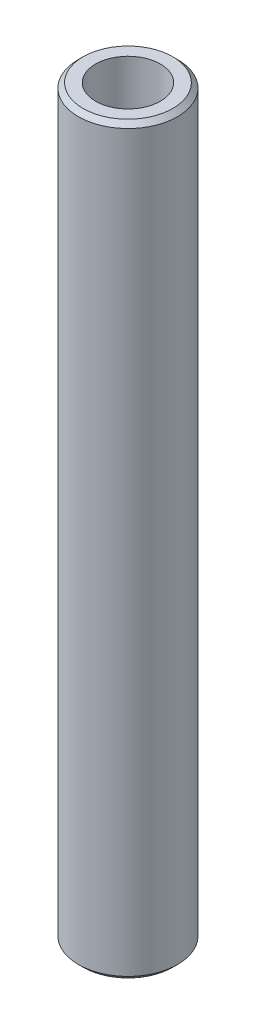
ISO-10303-21;
HEADER;
FILE_DESCRIPTION(('STEP AP214'),'2;1');
FILE_NAME('part.step','',(''),(''),'','','');
FILE_SCHEMA(('AUTOMOTIVE_DESIGN { 1 0 10303 214 1 1 1 1 }'));
ENDSEC;
DATA;
#1=APPLICATION_CONTEXT('core data for automotive mechanical design processes');
#2=APPLICATION_PROTOCOL_DEFINITION('international standard','automotive_design',2000,#1);
#3=PRODUCT_CONTEXT('',#1,'mechanical');
#4=PRODUCT('Part','Part','',(#3));
#5=PRODUCT_RELATED_PRODUCT_CATEGORY('part','',(#4));
#6=PRODUCT_DEFINITION_FORMATION('','',#4);
#7=PRODUCT_DEFINITION_CONTEXT('part definition',#1,'design');
#8=PRODUCT_DEFINITION('design','',#6,#7);
#9=PRODUCT_DEFINITION_SHAPE('','',#8);
#10=(LENGTH_UNIT() NAMED_UNIT(*) SI_UNIT(.MILLI.,.METRE.));
#11=(NAMED_UNIT(*) PLANE_ANGLE_UNIT() SI_UNIT($,.RADIAN.));
#12=(NAMED_UNIT(*) SI_UNIT($,.STERADIAN.) SOLID_ANGLE_UNIT());
#13=UNCERTAINTY_MEASURE_WITH_UNIT(LENGTH_MEASURE(1.E-05),#10,'distance_accuracy_value','');
#14=(GEOMETRIC_REPRESENTATION_CONTEXT(3) GLOBAL_UNCERTAINTY_ASSIGNED_CONTEXT((#13)) GLOBAL_UNIT_ASSIGNED_CONTEXT((#10,
#11,#12)) REPRESENTATION_CONTEXT('',''));
#15=CARTESIAN_POINT('',(0.,0.,0.));
#16=DIRECTION('',(0.,0.,1.));
#17=DIRECTION('',(1.,0.,0.));
#18=AXIS2_PLACEMENT_3D('',#15,#16,#17);
#19=CARTESIAN_POINT('',(0.,600.,0.));
#20=DIRECTION('',(0.,-1.,0.));
#21=DIRECTION('',(0.,0.,-1.));
#22=AXIS2_PLACEMENT_3D('',#19,#20,#21);
#23=CYLINDRICAL_SURFACE('',#22,40.);
#24=CARTESIAN_POINT('',(0.,596.178713852373,0.));
#25=DIRECTION('',(0.,1.,0.));
#26=DIRECTION('',(0.,0.,1.));
#27=AXIS2_PLACEMENT_3D('',#24,#25,#26);
#28=CIRCLE('',#27,40.);
#29=CARTESIAN_POINT('',(0.,596.178713852373,40.));
#30=VERTEX_POINT('',#29);
#31=EDGE_CURVE('E50',#30,#30,#28,.F.);
#32=ORIENTED_EDGE('',*,*,#31,.T.);
#33=EDGE_LOOP('',(#32));
#34=FACE_BOUND('',#33,.T.);
#35=CARTESIAN_POINT('',(0.,3.821286147627,0.));
#36=DIRECTION('',(0.,1.,0.));
#37=DIRECTION('',(0.,0.,1.));
#38=AXIS2_PLACEMENT_3D('',#35,#36,#37);
#39=CIRCLE('',#38,40.);
#40=CARTESIAN_POINT('',(0.,3.821286147627,40.));
#41=VERTEX_POINT('',#40);
#42=EDGE_CURVE('E51',#41,#41,#39,.T.);
#43=ORIENTED_EDGE('',*,*,#42,.T.);
#44=EDGE_LOOP('',(#43));
#45=FACE_BOUND('',#44,.T.);
#46=ADVANCED_FACE('F39',(#34,#45),#23,.T.);
#47=CARTESIAN_POINT('',(0.,600.,0.));
#48=DIRECTION('',(0.,1.,0.));
#49=DIRECTION('',(0.,0.,1.));
#50=AXIS2_PLACEMENT_3D('',#47,#48,#49);
#51=PLANE('',#50);
#52=CARTESIAN_POINT('',(0.,600.,0.));
#53=DIRECTION('',(0.,1.,0.));
#54=DIRECTION('',(0.,0.,1.));
#55=AXIS2_PLACEMENT_3D('',#52,#53,#54);
#56=CIRCLE('',#55,36.1787138523729);
#57=CARTESIAN_POINT('',(0.,600.,36.1787138523729));
#58=VERTEX_POINT('',#57);
#59=EDGE_CURVE('E54',#58,#58,#56,.T.);
#60=ORIENTED_EDGE('',*,*,#59,.T.);
#61=EDGE_LOOP('',(#60));
#62=FACE_BOUND('',#61,.T.);
#63=CARTESIAN_POINT('',(0.,600.,0.));
#64=DIRECTION('',(0.,1.,0.));
#65=DIRECTION('',(0.,0.,1.));
#66=AXIS2_PLACEMENT_3D('',#63,#64,#65);
#67=CIRCLE('',#66,26.0804491361756);
#68=CARTESIAN_POINT('',(0.,600.,26.0804491361756));
#69=VERTEX_POINT('',#68);
#70=EDGE_CURVE('E58',#69,#69,#67,.T.);
#71=ORIENTED_EDGE('',*,*,#70,.F.);
#72=EDGE_LOOP('',(#71));
#73=FACE_BOUND('',#72,.T.);
#74=ADVANCED_FACE('F69',(#62,#73),#51,.T.);
#75=CARTESIAN_POINT('',(0.,0.,0.));
#76=DIRECTION('',(0.,1.,0.));
#77=DIRECTION('',(0.,0.,1.));
#78=AXIS2_PLACEMENT_3D('',#75,#76,#77);
#79=PLANE('',#78);
#80=CARTESIAN_POINT('',(0.,0.,0.));
#81=DIRECTION('',(0.,1.,0.));
#82=DIRECTION('',(0.,0.,1.));
#83=AXIS2_PLACEMENT_3D('',#80,#81,#82);
#84=CIRCLE('',#83,36.178713852373);
#85=CARTESIAN_POINT('',(0.,0.,36.178713852373));
#86=VERTEX_POINT('',#85);
#87=EDGE_CURVE('E10',#86,#86,#84,.F.);
#88=ORIENTED_EDGE('',*,*,#87,.T.);
#89=EDGE_LOOP('',(#88));
#90=FACE_BOUND('',#89,.T.);
#91=CARTESIAN_POINT('',(0.,0.,0.));
#92=DIRECTION('',(0.,1.,0.));
#93=DIRECTION('',(0.,0.,1.));
#94=AXIS2_PLACEMENT_3D('',#91,#92,#93);
#95=CIRCLE('',#94,26.0804491361756);
#96=CARTESIAN_POINT('',(0.,0.,26.0804491361756));
#97=VERTEX_POINT('',#96);
#98=EDGE_CURVE('E63',#97,#97,#95,.T.);
#99=ORIENTED_EDGE('',*,*,#98,.T.);
#100=EDGE_LOOP('',(#99));
#101=FACE_BOUND('',#100,.T.);
#102=ADVANCED_FACE('F75',(#90,#101),#79,.F.);
#103=CARTESIAN_POINT('',(0.,600.,0.));
#104=DIRECTION('',(0.,-1.,0.));
#105=DIRECTION('',(0.,0.,-1.));
#106=AXIS2_PLACEMENT_3D('',#103,#104,#105);
#107=CYLINDRICAL_SURFACE('',#106,26.0804491361756);
#108=ORIENTED_EDGE('',*,*,#70,.T.);
#109=EDGE_LOOP('',(#108));
#110=FACE_BOUND('',#109,.T.);
#111=ORIENTED_EDGE('',*,*,#98,.F.);
#112=EDGE_LOOP('',(#111));
#113=FACE_BOUND('',#112,.T.);
#114=ADVANCED_FACE('F70',(#110,#113),#107,.F.);
#115=CARTESIAN_POINT('',(0.,600.,0.));
#116=DIRECTION('',(0.,-1.,0.));
#117=DIRECTION('',(0.,0.,-1.));
#118=AXIS2_PLACEMENT_3D('',#115,#116,#117);
#119=CONICAL_SURFACE('',#118,36.1787138523729,0.785398163397444);
#120=ORIENTED_EDGE('',*,*,#31,.F.);
#121=EDGE_LOOP('',(#120));
#122=FACE_BOUND('',#121,.T.);
#123=ORIENTED_EDGE('',*,*,#59,.F.);
#124=EDGE_LOOP('',(#123));
#125=FACE_BOUND('',#124,.T.);
#126=ADVANCED_FACE('F81',(#122,#125),#119,.T.);
#127=CARTESIAN_POINT('',(0.,3.821286147627,0.));
#128=DIRECTION('',(0.,1.,0.));
#129=DIRECTION('',(0.,0.,1.));
#130=AXIS2_PLACEMENT_3D('',#127,#128,#129);
#131=CONICAL_SURFACE('',#130,40.,0.785398163397444);
#132=ORIENTED_EDGE('',*,*,#87,.F.);
#133=EDGE_LOOP('',(#132));
#134=FACE_BOUND('',#133,.T.);
#135=ORIENTED_EDGE('',*,*,#42,.F.);
#136=EDGE_LOOP('',(#135));
#137=FACE_BOUND('',#136,.T.);
#138=ADVANCED_FACE('F45',(#134,#137),#131,.T.);
#139=CLOSED_SHELL('',(#46,#74,#102,#114,#126,#138));
#140=MANIFOLD_SOLID_BREP('B2',#139);
#141=ADVANCED_BREP_SHAPE_REPRESENTATION('',(#18,#140),#14);
#142=SHAPE_DEFINITION_REPRESENTATION(#9,#141);
ENDSEC;
END-ISO-10303-21;
